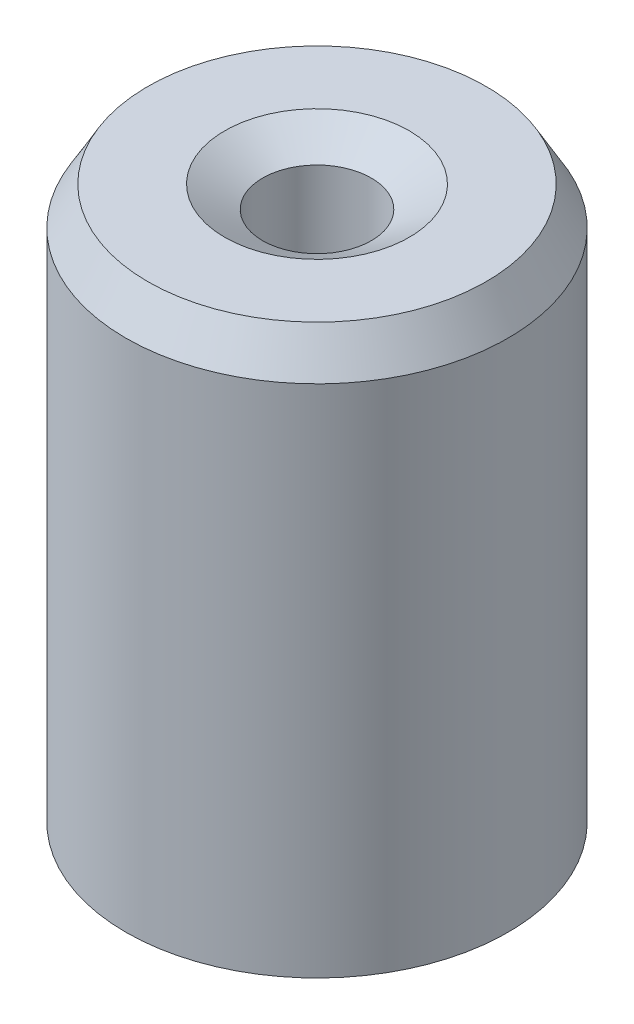
ISO-10303-21;
HEADER;
FILE_DESCRIPTION(('STEP AP214'),'2;1');
FILE_NAME('part.step','',(''),(''),'','','');
FILE_SCHEMA(('AUTOMOTIVE_DESIGN { 1 0 10303 214 1 1 1 1 }'));
ENDSEC;
DATA;
#1=APPLICATION_CONTEXT('core data for automotive mechanical design processes');
#2=APPLICATION_PROTOCOL_DEFINITION('international standard','automotive_design',2000,#1);
#3=PRODUCT_CONTEXT('',#1,'mechanical');
#4=PRODUCT('Part','Part','',(#3));
#5=PRODUCT_RELATED_PRODUCT_CATEGORY('part','',(#4));
#6=PRODUCT_DEFINITION_FORMATION('','',#4);
#7=PRODUCT_DEFINITION_CONTEXT('part definition',#1,'design');
#8=PRODUCT_DEFINITION('design','',#6,#7);
#9=PRODUCT_DEFINITION_SHAPE('','',#8);
#10=(LENGTH_UNIT() NAMED_UNIT(*) SI_UNIT(.MILLI.,.METRE.));
#11=(NAMED_UNIT(*) PLANE_ANGLE_UNIT() SI_UNIT($,.RADIAN.));
#12=(NAMED_UNIT(*) SI_UNIT($,.STERADIAN.) SOLID_ANGLE_UNIT());
#13=UNCERTAINTY_MEASURE_WITH_UNIT(LENGTH_MEASURE(1.E-05),#10,'distance_accuracy_value','');
#14=(GEOMETRIC_REPRESENTATION_CONTEXT(3) GLOBAL_UNCERTAINTY_ASSIGNED_CONTEXT((#13)) GLOBAL_UNIT_ASSIGNED_CONTEXT((#10,
#11,#12)) REPRESENTATION_CONTEXT('',''));
#15=CARTESIAN_POINT('',(0.,0.,0.));
#16=DIRECTION('',(0.,0.,1.));
#17=DIRECTION('',(1.,0.,0.));
#18=AXIS2_PLACEMENT_3D('',#15,#16,#17);
#19=CARTESIAN_POINT('',(0.,15.0318166564436,0.));
#20=DIRECTION('',(0.,-1.,0.));
#21=DIRECTION('',(0.,0.,-1.));
#22=AXIS2_PLACEMENT_3D('',#19,#20,#21);
#23=CYLINDRICAL_SURFACE('',#22,5.);
#24=CARTESIAN_POINT('',(0.,0.573427294331474,0.));
#25=DIRECTION('',(0.,1.,0.));
#26=DIRECTION('',(0.,0.,1.));
#27=AXIS2_PLACEMENT_3D('',#24,#25,#26);
#28=CIRCLE('',#27,5.);
#29=CARTESIAN_POINT('',(0.,0.573427294331474,5.));
#30=VERTEX_POINT('',#29);
#31=EDGE_CURVE('E10',#30,#30,#28,.T.);
#32=ORIENTED_EDGE('',*,*,#31,.T.);
#33=EDGE_LOOP('',(#32));
#34=FACE_BOUND('',#33,.T.);
#35=CARTESIAN_POINT('',(0.,14.0386114482148,0.));
#36=DIRECTION('',(0.,1.,0.));
#37=DIRECTION('',(0.,0.,1.));
#38=AXIS2_PLACEMENT_3D('',#35,#36,#37);
#39=CIRCLE('',#38,5.);
#40=CARTESIAN_POINT('',(0.,14.0386114482148,5.));
#41=VERTEX_POINT('',#40);
#42=EDGE_CURVE('E50',#41,#41,#39,.F.);
#43=ORIENTED_EDGE('',*,*,#42,.T.);
#44=EDGE_LOOP('',(#43));
#45=FACE_BOUND('',#44,.T.);
#46=ADVANCED_FACE('F39',(#34,#45),#23,.T.);
#47=CARTESIAN_POINT('',(0.,15.0318166564436,0.));
#48=DIRECTION('',(0.,1.,0.));
#49=DIRECTION('',(0.,0.,1.));
#50=AXIS2_PLACEMENT_3D('',#47,#48,#49);
#51=PLANE('',#50);
#52=CARTESIAN_POINT('',(0.,15.0318166564436,0.));
#53=DIRECTION('',(0.,1.,0.));
#54=DIRECTION('',(0.,0.,1.));
#55=AXIS2_PLACEMENT_3D('',#52,#53,#54);
#56=CIRCLE('',#55,2.41503458865775);
#57=CARTESIAN_POINT('',(0.,15.0318166564436,2.41503458865775));
#58=VERTEX_POINT('',#57);
#59=EDGE_CURVE('E58',#58,#58,#56,.F.);
#60=ORIENTED_EDGE('',*,*,#59,.T.);
#61=EDGE_LOOP('',(#60));
#62=FACE_BOUND('',#61,.T.);
#63=CARTESIAN_POINT('',(0.,15.0318166564436,0.));
#64=DIRECTION('',(0.,1.,0.));
#65=DIRECTION('',(0.,0.,1.));
#66=AXIS2_PLACEMENT_3D('',#63,#64,#65);
#67=CIRCLE('',#66,4.42657270566853);
#68=CARTESIAN_POINT('',(0.,15.0318166564436,4.42657270566853));
#69=VERTEX_POINT('',#68);
#70=EDGE_CURVE('E61',#69,#69,#67,.T.);
#71=ORIENTED_EDGE('',*,*,#70,.T.);
#72=EDGE_LOOP('',(#71));
#73=FACE_BOUND('',#72,.T.);
#74=ADVANCED_FACE('F88',(#62,#73),#51,.T.);
#75=CARTESIAN_POINT('',(0.,0.,0.));
#76=DIRECTION('',(0.,1.,0.));
#77=DIRECTION('',(0.,0.,1.));
#78=AXIS2_PLACEMENT_3D('',#75,#76,#77);
#79=PLANE('',#78);
#80=CARTESIAN_POINT('',(0.,0.,0.));
#81=DIRECTION('',(0.,1.,0.));
#82=DIRECTION('',(0.,0.,1.));
#83=AXIS2_PLACEMENT_3D('',#80,#81,#82);
#84=CIRCLE('',#83,1.99525667476035);
#85=CARTESIAN_POINT('',(0.,0.,1.99525667476035));
#86=VERTEX_POINT('',#85);
#87=EDGE_CURVE('E51',#86,#86,#84,.T.);
#88=ORIENTED_EDGE('',*,*,#87,.T.);
#89=EDGE_LOOP('',(#88));
#90=FACE_BOUND('',#89,.T.);
#91=CARTESIAN_POINT('',(0.,0.,0.));
#92=DIRECTION('',(0.,1.,0.));
#93=DIRECTION('',(0.,0.,1.));
#94=AXIS2_PLACEMENT_3D('',#91,#92,#93);
#95=CIRCLE('',#94,4.00679479177113);
#96=CARTESIAN_POINT('',(0.,0.,4.00679479177113));
#97=VERTEX_POINT('',#96);
#98=EDGE_CURVE('E54',#97,#97,#95,.F.);
#99=ORIENTED_EDGE('',*,*,#98,.T.);
#100=EDGE_LOOP('',(#99));
#101=FACE_BOUND('',#100,.T.);
#102=ADVANCED_FACE('F83',(#90,#101),#79,.F.);
#103=CARTESIAN_POINT('',(0.,15.0318166564436,0.));
#104=DIRECTION('',(0.,-1.,0.));
#105=DIRECTION('',(0.,0.,-1.));
#106=AXIS2_PLACEMENT_3D('',#103,#104,#105);
#107=CYLINDRICAL_SURFACE('',#106,1.42182938042888);
#108=CARTESIAN_POINT('',(0.,14.4583893621122,0.));
#109=DIRECTION('',(0.,1.,0.));
#110=DIRECTION('',(0.,0.,1.));
#111=AXIS2_PLACEMENT_3D('',#108,#109,#110);
#112=CIRCLE('',#111,1.42182938042888);
#113=CARTESIAN_POINT('',(0.,14.4583893621122,1.42182938042888));
#114=VERTEX_POINT('',#113);
#115=EDGE_CURVE('E67',#114,#114,#112,.T.);
#116=ORIENTED_EDGE('',*,*,#115,.T.);
#117=EDGE_LOOP('',(#116));
#118=FACE_BOUND('',#117,.T.);
#119=CARTESIAN_POINT('',(0.,0.99320520822887,0.));
#120=DIRECTION('',(0.,1.,0.));
#121=DIRECTION('',(0.,0.,1.));
#122=AXIS2_PLACEMENT_3D('',#119,#120,#121);
#123=CIRCLE('',#122,1.42182938042888);
#124=CARTESIAN_POINT('',(0.,0.99320520822887,1.42182938042888));
#125=VERTEX_POINT('',#124);
#126=EDGE_CURVE('E69',#125,#125,#123,.F.);
#127=ORIENTED_EDGE('',*,*,#126,.T.);
#128=EDGE_LOOP('',(#127));
#129=FACE_BOUND('',#128,.T.);
#130=ADVANCED_FACE('F71',(#118,#129),#107,.F.);
#131=CARTESIAN_POINT('',(0.,14.4583893621122,0.));
#132=DIRECTION('',(0.,1.,0.));
#133=DIRECTION('',(0.,0.,1.));
#134=AXIS2_PLACEMENT_3D('',#131,#132,#133);
#135=CONICAL_SURFACE('',#134,1.42182938042888,1.0471975511966);
#136=ORIENTED_EDGE('',*,*,#59,.F.);
#137=EDGE_LOOP('',(#136));
#138=FACE_BOUND('',#137,.T.);
#139=ORIENTED_EDGE('',*,*,#115,.F.);
#140=EDGE_LOOP('',(#139));
#141=FACE_BOUND('',#140,.T.);
#142=ADVANCED_FACE('F77',(#138,#141),#135,.F.);
#143=CARTESIAN_POINT('',(0.,0.,0.));
#144=DIRECTION('',(0.,-1.,0.));
#145=DIRECTION('',(0.,0.,-1.));
#146=AXIS2_PLACEMENT_3D('',#143,#144,#145);
#147=CONICAL_SURFACE('',#146,1.99525667476035,0.523598775598296);
#148=ORIENTED_EDGE('',*,*,#126,.F.);
#149=EDGE_LOOP('',(#148));
#150=FACE_BOUND('',#149,.T.);
#151=ORIENTED_EDGE('',*,*,#87,.F.);
#152=EDGE_LOOP('',(#151));
#153=FACE_BOUND('',#152,.T.);
#154=ADVANCED_FACE('F73',(#150,#153),#147,.F.);
#155=CARTESIAN_POINT('',(0.,0.573427294331474,0.));
#156=DIRECTION('',(0.,1.,0.));
#157=DIRECTION('',(0.,0.,1.));
#158=AXIS2_PLACEMENT_3D('',#155,#156,#157);
#159=CONICAL_SURFACE('',#158,5.,1.0471975511966);
#160=ORIENTED_EDGE('',*,*,#98,.F.);
#161=EDGE_LOOP('',(#160));
#162=FACE_BOUND('',#161,.T.);
#163=ORIENTED_EDGE('',*,*,#31,.F.);
#164=EDGE_LOOP('',(#163));
#165=FACE_BOUND('',#164,.T.);
#166=ADVANCED_FACE('F76',(#162,#165),#159,.T.);
#167=CARTESIAN_POINT('',(0.,15.0318166564436,0.));
#168=DIRECTION('',(0.,-1.,0.));
#169=DIRECTION('',(0.,0.,-1.));
#170=AXIS2_PLACEMENT_3D('',#167,#168,#169);
#171=CONICAL_SURFACE('',#170,4.42657270566853,0.523598775598295);
#172=ORIENTED_EDGE('',*,*,#42,.F.);
#173=EDGE_LOOP('',(#172));
#174=FACE_BOUND('',#173,.T.);
#175=ORIENTED_EDGE('',*,*,#70,.F.);
#176=EDGE_LOOP('',(#175));
#177=FACE_BOUND('',#176,.T.);
#178=ADVANCED_FACE('F45',(#174,#177),#171,.T.);
#179=CLOSED_SHELL('',(#46,#74,#102,#130,#142,#154,#166,#178));
#180=MANIFOLD_SOLID_BREP('B2',#179);
#181=ADVANCED_BREP_SHAPE_REPRESENTATION('',(#18,#180),#14);
#182=SHAPE_DEFINITION_REPRESENTATION(#9,#181);
ENDSEC;
END-ISO-10303-21;
